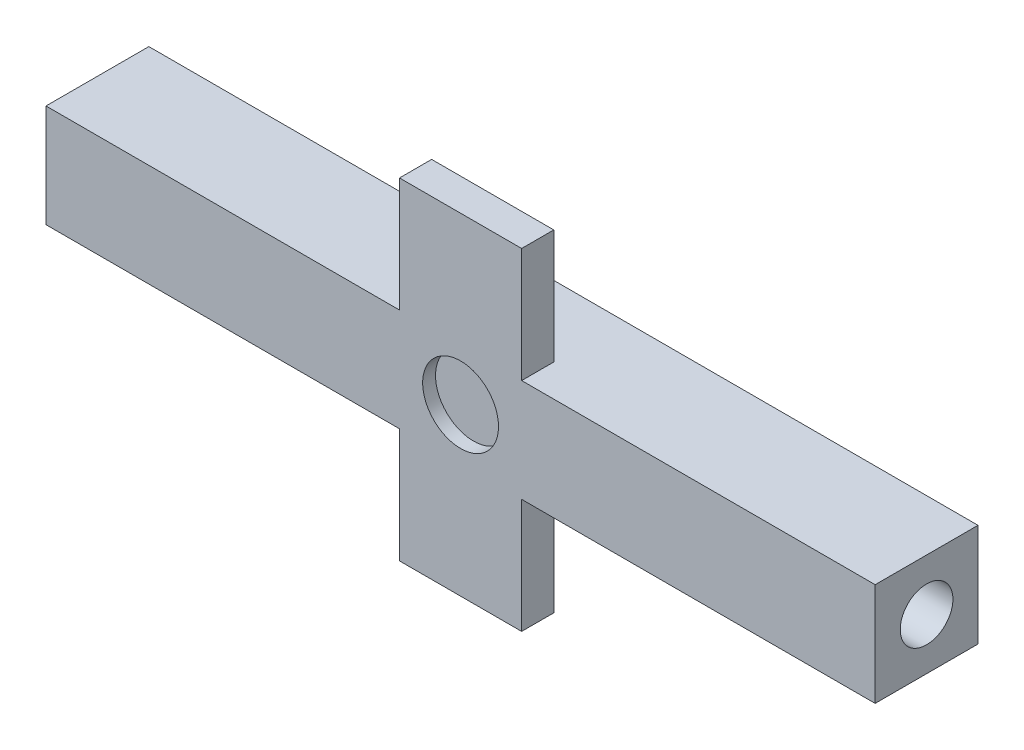
ISO-10303-21;
HEADER;
FILE_DESCRIPTION(('STEP AP214'),'2;1');
FILE_NAME('part.step','',(''),(''),'','','');
FILE_SCHEMA(('AUTOMOTIVE_DESIGN { 1 0 10303 214 1 1 1 1 }'));
ENDSEC;
DATA;
#1=APPLICATION_CONTEXT('core data for automotive mechanical design processes');
#2=APPLICATION_PROTOCOL_DEFINITION('international standard','automotive_design',2000,#1);
#3=PRODUCT_CONTEXT('',#1,'mechanical');
#4=PRODUCT('Part','Part','',(#3));
#5=PRODUCT_RELATED_PRODUCT_CATEGORY('part','',(#4));
#6=PRODUCT_DEFINITION_FORMATION('','',#4);
#7=PRODUCT_DEFINITION_CONTEXT('part definition',#1,'design');
#8=PRODUCT_DEFINITION('design','',#6,#7);
#9=PRODUCT_DEFINITION_SHAPE('','',#8);
#10=(LENGTH_UNIT() NAMED_UNIT(*) SI_UNIT(.MILLI.,.METRE.));
#11=(NAMED_UNIT(*) PLANE_ANGLE_UNIT() SI_UNIT($,.RADIAN.));
#12=(NAMED_UNIT(*) SI_UNIT($,.STERADIAN.) SOLID_ANGLE_UNIT());
#13=UNCERTAINTY_MEASURE_WITH_UNIT(LENGTH_MEASURE(1.E-05),#10,'distance_accuracy_value','');
#14=(GEOMETRIC_REPRESENTATION_CONTEXT(3) GLOBAL_UNCERTAINTY_ASSIGNED_CONTEXT((#13)) GLOBAL_UNIT_ASSIGNED_CONTEXT((#10,
#11,#12)) REPRESENTATION_CONTEXT('',''));
#15=CARTESIAN_POINT('',(0.,0.,0.));
#16=DIRECTION('',(0.,0.,1.));
#17=DIRECTION('',(1.,0.,0.));
#18=AXIS2_PLACEMENT_3D('',#15,#16,#17);
#19=CARTESIAN_POINT('',(81.915,10.16,0.));
#20=DIRECTION('',(0.,-1.,0.));
#21=DIRECTION('',(0.,0.,-1.));
#22=AXIS2_PLACEMENT_3D('',#19,#20,#21);
#23=PLANE('',#22);
#24=DIRECTION('',(0.,0.,-1.));
#25=VECTOR('',#24,1.);
#26=CARTESIAN_POINT('',(46.99,10.16,0.));
#27=LINE('',#26,#25);
#28=CARTESIAN_POINT('',(46.99,10.16,0.));
#29=VERTEX_POINT('',#28);
#30=CARTESIAN_POINT('',(46.99,10.16,-3.175));
#31=VERTEX_POINT('',#30);
#32=EDGE_CURVE('E151',#29,#31,#27,.T.);
#33=ORIENTED_EDGE('',*,*,#32,.F.);
#34=DIRECTION('',(-1.,0.,0.));
#35=VECTOR('',#34,1.);
#36=CARTESIAN_POINT('',(81.915,10.16,0.));
#37=LINE('',#36,#35);
#38=CARTESIAN_POINT('',(81.915,10.16,0.));
#39=VERTEX_POINT('',#38);
#40=EDGE_CURVE('E242',#39,#29,#37,.T.);
#41=ORIENTED_EDGE('',*,*,#40,.F.);
#42=DIRECTION('',(0.,0.,1.));
#43=VECTOR('',#42,1.);
#44=CARTESIAN_POINT('',(81.915,10.16,0.));
#45=LINE('',#44,#43);
#46=CARTESIAN_POINT('',(81.915,10.16,-10.16));
#47=VERTEX_POINT('',#46);
#48=EDGE_CURVE('E228',#47,#39,#45,.T.);
#49=ORIENTED_EDGE('',*,*,#48,.F.);
#50=DIRECTION('',(-1.,0.,0.));
#51=VECTOR('',#50,1.);
#52=CARTESIAN_POINT('',(81.915,10.16,-10.16));
#53=LINE('',#52,#51);
#54=CARTESIAN_POINT('',(0.,10.16,-10.16));
#55=VERTEX_POINT('',#54);
#56=EDGE_CURVE('E246',#47,#55,#53,.T.);
#57=ORIENTED_EDGE('',*,*,#56,.T.);
#58=DIRECTION('',(0.,0.,1.));
#59=VECTOR('',#58,1.);
#60=CARTESIAN_POINT('',(0.,10.16,0.));
#61=LINE('',#60,#59);
#62=CARTESIAN_POINT('',(0.,10.16,0.));
#63=VERTEX_POINT('',#62);
#64=EDGE_CURVE('E222',#55,#63,#61,.T.);
#65=ORIENTED_EDGE('',*,*,#64,.T.);
#66=CARTESIAN_POINT('',(34.925,10.16,0.));
#67=VERTEX_POINT('',#66);
#68=EDGE_CURVE('E61',#67,#63,#37,.T.);
#69=ORIENTED_EDGE('',*,*,#68,.F.);
#70=DIRECTION('',(0.,0.,1.));
#71=VECTOR('',#70,1.);
#72=CARTESIAN_POINT('',(34.925,10.16,0.));
#73=LINE('',#72,#71);
#74=CARTESIAN_POINT('',(34.925,10.16,-3.175));
#75=VERTEX_POINT('',#74);
#76=EDGE_CURVE('E148',#75,#67,#73,.T.);
#77=ORIENTED_EDGE('',*,*,#76,.F.);
#78=DIRECTION('',(-1.,0.,0.));
#79=VECTOR('',#78,1.);
#80=CARTESIAN_POINT('',(46.99,10.16,-3.175));
#81=LINE('',#80,#79);
#82=EDGE_CURVE('E55',#31,#75,#81,.T.);
#83=ORIENTED_EDGE('',*,*,#82,.F.);
#84=EDGE_LOOP('',(#33,#41,#49,#57,#65,#69,#77,#83));
#85=FACE_BOUND('',#84,.T.);
#86=ADVANCED_FACE('F39',(#85),#23,.F.);
#87=CARTESIAN_POINT('',(81.915,0.,0.));
#88=DIRECTION('',(0.,1.,0.));
#89=DIRECTION('',(0.,0.,1.));
#90=AXIS2_PLACEMENT_3D('',#87,#88,#89);
#91=PLANE('',#90);
#92=DIRECTION('',(0.,0.,1.));
#93=VECTOR('',#92,1.);
#94=CARTESIAN_POINT('',(46.99,0.,0.));
#95=LINE('',#94,#93);
#96=CARTESIAN_POINT('',(46.99,0.,-3.175));
#97=VERTEX_POINT('',#96);
#98=CARTESIAN_POINT('',(46.99,0.,0.));
#99=VERTEX_POINT('',#98);
#100=EDGE_CURVE('E153',#97,#99,#95,.T.);
#101=ORIENTED_EDGE('',*,*,#100,.F.);
#102=DIRECTION('',(1.,0.,0.));
#103=VECTOR('',#102,1.);
#104=CARTESIAN_POINT('',(46.99,0.,-3.175));
#105=LINE('',#104,#103);
#106=CARTESIAN_POINT('',(34.925,0.,-3.175));
#107=VERTEX_POINT('',#106);
#108=EDGE_CURVE('E169',#107,#97,#105,.T.);
#109=ORIENTED_EDGE('',*,*,#108,.F.);
#110=DIRECTION('',(0.,0.,-1.));
#111=VECTOR('',#110,1.);
#112=CARTESIAN_POINT('',(34.925,0.,0.));
#113=LINE('',#112,#111);
#114=CARTESIAN_POINT('',(34.925,0.,0.));
#115=VERTEX_POINT('',#114);
#116=EDGE_CURVE('E158',#115,#107,#113,.T.);
#117=ORIENTED_EDGE('',*,*,#116,.F.);
#118=DIRECTION('',(-1.,0.,0.));
#119=VECTOR('',#118,1.);
#120=CARTESIAN_POINT('',(81.915,0.,0.));
#121=LINE('',#120,#119);
#122=CARTESIAN_POINT('',(0.,0.,0.));
#123=VERTEX_POINT('',#122);
#124=EDGE_CURVE('E48',#115,#123,#121,.T.);
#125=ORIENTED_EDGE('',*,*,#124,.T.);
#126=DIRECTION('',(0.,0.,-1.));
#127=VECTOR('',#126,1.);
#128=CARTESIAN_POINT('',(0.,0.,0.));
#129=LINE('',#128,#127);
#130=CARTESIAN_POINT('',(0.,0.,-10.16));
#131=VERTEX_POINT('',#130);
#132=EDGE_CURVE('E234',#123,#131,#129,.T.);
#133=ORIENTED_EDGE('',*,*,#132,.T.);
#134=DIRECTION('',(-1.,0.,0.));
#135=VECTOR('',#134,1.);
#136=CARTESIAN_POINT('',(81.915,0.,-10.16));
#137=LINE('',#136,#135);
#138=CARTESIAN_POINT('',(81.915,0.,-10.16));
#139=VERTEX_POINT('',#138);
#140=EDGE_CURVE('E249',#139,#131,#137,.T.);
#141=ORIENTED_EDGE('',*,*,#140,.F.);
#142=DIRECTION('',(0.,0.,-1.));
#143=VECTOR('',#142,1.);
#144=CARTESIAN_POINT('',(81.915,0.,0.));
#145=LINE('',#144,#143);
#146=CARTESIAN_POINT('',(81.915,0.,0.));
#147=VERTEX_POINT('',#146);
#148=EDGE_CURVE('E221',#147,#139,#145,.T.);
#149=ORIENTED_EDGE('',*,*,#148,.F.);
#150=EDGE_CURVE('E11',#147,#99,#121,.T.);
#151=ORIENTED_EDGE('',*,*,#150,.T.);
#152=EDGE_LOOP('',(#101,#109,#117,#125,#133,#141,#149,#151));
#153=FACE_BOUND('',#152,.T.);
#154=ADVANCED_FACE('F260',(#153),#91,.F.);
#155=CARTESIAN_POINT('',(81.915,0.,0.));
#156=DIRECTION('',(0.,0.,-1.));
#157=DIRECTION('',(-1.,0.,0.));
#158=AXIS2_PLACEMENT_3D('',#155,#156,#157);
#159=PLANE('',#158);
#160=CARTESIAN_POINT('',(40.9575,5.08,0.));
#161=DIRECTION('',(0.,0.,1.));
#162=DIRECTION('',(1.,0.,0.));
#163=AXIS2_PLACEMENT_3D('',#160,#161,#162);
#164=CIRCLE('',#163,3.7465);
#165=CARTESIAN_POINT('',(44.704,5.08,0.));
#166=VERTEX_POINT('',#165);
#167=EDGE_CURVE('E200',#166,#166,#164,.T.);
#168=ORIENTED_EDGE('',*,*,#167,.F.);
#169=EDGE_LOOP('',(#168));
#170=FACE_BOUND('',#169,.T.);
#171=DIRECTION('',(0.,-1.,0.));
#172=VECTOR('',#171,1.);
#173=CARTESIAN_POINT('',(0.,0.,0.));
#174=LINE('',#173,#172);
#175=EDGE_CURVE('E213',#63,#123,#174,.T.);
#176=ORIENTED_EDGE('',*,*,#175,.T.);
#177=ORIENTED_EDGE('',*,*,#124,.F.);
#178=DIRECTION('',(0.,1.,0.));
#179=VECTOR('',#178,1.);
#180=CARTESIAN_POINT('',(34.925,-11.303,0.));
#181=LINE('',#180,#179);
#182=CARTESIAN_POINT('',(34.925,-11.303,0.));
#183=VERTEX_POINT('',#182);
#184=EDGE_CURVE('E192',#183,#115,#181,.T.);
#185=ORIENTED_EDGE('',*,*,#184,.F.);
#186=DIRECTION('',(-1.,0.,0.));
#187=VECTOR('',#186,1.);
#188=CARTESIAN_POINT('',(46.99,-11.303,0.));
#189=LINE('',#188,#187);
#190=CARTESIAN_POINT('',(46.99,-11.303,0.));
#191=VERTEX_POINT('',#190);
#192=EDGE_CURVE('E168',#191,#183,#189,.T.);
#193=ORIENTED_EDGE('',*,*,#192,.F.);
#194=DIRECTION('',(0.,1.,0.));
#195=VECTOR('',#194,1.);
#196=CARTESIAN_POINT('',(46.99,-11.303,0.));
#197=LINE('',#196,#195);
#198=EDGE_CURVE('E196',#191,#99,#197,.T.);
#199=ORIENTED_EDGE('',*,*,#198,.T.);
#200=ORIENTED_EDGE('',*,*,#150,.F.);
#201=DIRECTION('',(0.,-1.,0.));
#202=VECTOR('',#201,1.);
#203=CARTESIAN_POINT('',(81.915,0.,0.));
#204=LINE('',#203,#202);
#205=EDGE_CURVE('E217',#39,#147,#204,.T.);
#206=ORIENTED_EDGE('',*,*,#205,.F.);
#207=ORIENTED_EDGE('',*,*,#40,.T.);
#208=DIRECTION('',(0.,-1.,0.));
#209=VECTOR('',#208,1.);
#210=CARTESIAN_POINT('',(46.99,21.463,0.));
#211=LINE('',#210,#209);
#212=CARTESIAN_POINT('',(46.99,21.463,0.));
#213=VERTEX_POINT('',#212);
#214=EDGE_CURVE('E401',#213,#29,#211,.T.);
#215=ORIENTED_EDGE('',*,*,#214,.F.);
#216=DIRECTION('',(1.,0.,0.));
#217=VECTOR('',#216,1.);
#218=CARTESIAN_POINT('',(46.99,21.463,0.));
#219=LINE('',#218,#217);
#220=CARTESIAN_POINT('',(34.925,21.463,0.));
#221=VERTEX_POINT('',#220);
#222=EDGE_CURVE('E143',#221,#213,#219,.T.);
#223=ORIENTED_EDGE('',*,*,#222,.F.);
#224=DIRECTION('',(0.,-1.,0.));
#225=VECTOR('',#224,1.);
#226=CARTESIAN_POINT('',(34.925,21.463,0.));
#227=LINE('',#226,#225);
#228=EDGE_CURVE('E160',#221,#67,#227,.T.);
#229=ORIENTED_EDGE('',*,*,#228,.T.);
#230=ORIENTED_EDGE('',*,*,#68,.T.);
#231=EDGE_LOOP('',(#176,#177,#185,#193,#199,#200,#206,#207,#215,#223,#229,#230));
#232=FACE_BOUND('',#231,.T.);
#233=ADVANCED_FACE('F41',(#170,#232),#159,.F.);
#234=CARTESIAN_POINT('',(81.915,0.,-10.16));
#235=DIRECTION('',(0.,0.,1.));
#236=DIRECTION('',(1.,0.,0.));
#237=AXIS2_PLACEMENT_3D('',#234,#235,#236);
#238=PLANE('',#237);
#239=DIRECTION('',(0.,1.,0.));
#240=VECTOR('',#239,1.);
#241=CARTESIAN_POINT('',(0.,0.,-10.16));
#242=LINE('',#241,#240);
#243=EDGE_CURVE('E237',#131,#55,#242,.T.);
#244=ORIENTED_EDGE('',*,*,#243,.T.);
#245=ORIENTED_EDGE('',*,*,#56,.F.);
#246=DIRECTION('',(0.,1.,0.));
#247=VECTOR('',#246,1.);
#248=CARTESIAN_POINT('',(81.915,0.,-10.16));
#249=LINE('',#248,#247);
#250=EDGE_CURVE('E225',#139,#47,#249,.T.);
#251=ORIENTED_EDGE('',*,*,#250,.F.);
#252=ORIENTED_EDGE('',*,*,#140,.T.);
#253=EDGE_LOOP('',(#244,#245,#251,#252));
#254=FACE_BOUND('',#253,.T.);
#255=ADVANCED_FACE('F273',(#254),#238,.F.);
#256=CARTESIAN_POINT('',(81.915,0.,0.));
#257=DIRECTION('',(-1.,0.,0.));
#258=DIRECTION('',(0.,0.,1.));
#259=AXIS2_PLACEMENT_3D('',#256,#257,#258);
#260=PLANE('',#259);
#261=CARTESIAN_POINT('',(81.915,5.08,-5.08));
#262=DIRECTION('',(1.,0.,0.));
#263=DIRECTION('',(0.,0.,-1.));
#264=AXIS2_PLACEMENT_3D('',#261,#262,#263);
#265=CIRCLE('',#264,2.6035);
#266=CARTESIAN_POINT('',(81.915,5.08,-7.6835));
#267=VERTEX_POINT('',#266);
#268=EDGE_CURVE('E205',#267,#267,#265,.T.);
#269=ORIENTED_EDGE('',*,*,#268,.F.);
#270=EDGE_LOOP('',(#269));
#271=FACE_BOUND('',#270,.T.);
#272=ORIENTED_EDGE('',*,*,#205,.T.);
#273=ORIENTED_EDGE('',*,*,#148,.T.);
#274=ORIENTED_EDGE('',*,*,#250,.T.);
#275=ORIENTED_EDGE('',*,*,#48,.T.);
#276=EDGE_LOOP('',(#272,#273,#274,#275));
#277=FACE_BOUND('',#276,.T.);
#278=ADVANCED_FACE('F275',(#271,#277),#260,.F.);
#279=CARTESIAN_POINT('',(0.,0.,0.));
#280=DIRECTION('',(-1.,0.,0.));
#281=DIRECTION('',(0.,0.,1.));
#282=AXIS2_PLACEMENT_3D('',#279,#280,#281);
#283=PLANE('',#282);
#284=CARTESIAN_POINT('',(0.,5.08,-5.08));
#285=DIRECTION('',(1.,0.,0.));
#286=DIRECTION('',(0.,0.,-1.));
#287=AXIS2_PLACEMENT_3D('',#284,#285,#286);
#288=CIRCLE('',#287,2.6035);
#289=CARTESIAN_POINT('',(0.,5.08,-7.6835));
#290=VERTEX_POINT('',#289);
#291=EDGE_CURVE('E209',#290,#290,#288,.T.);
#292=ORIENTED_EDGE('',*,*,#291,.T.);
#293=EDGE_LOOP('',(#292));
#294=FACE_BOUND('',#293,.T.);
#295=ORIENTED_EDGE('',*,*,#175,.F.);
#296=ORIENTED_EDGE('',*,*,#64,.F.);
#297=ORIENTED_EDGE('',*,*,#243,.F.);
#298=ORIENTED_EDGE('',*,*,#132,.F.);
#299=EDGE_LOOP('',(#295,#296,#297,#298));
#300=FACE_BOUND('',#299,.T.);
#301=ADVANCED_FACE('F265',(#294,#300),#283,.T.);
#302=CARTESIAN_POINT('',(0.,5.08,-5.08));
#303=DIRECTION('',(1.,0.,0.));
#304=DIRECTION('',(0.,0.,-1.));
#305=AXIS2_PLACEMENT_3D('',#302,#303,#304);
#306=CYLINDRICAL_SURFACE('',#305,2.6035);
#307=ORIENTED_EDGE('',*,*,#291,.F.);
#308=EDGE_LOOP('',(#307));
#309=FACE_BOUND('',#308,.T.);
#310=ORIENTED_EDGE('',*,*,#268,.T.);
#311=EDGE_LOOP('',(#310));
#312=FACE_BOUND('',#311,.T.);
#313=ADVANCED_FACE('F322',(#309,#312),#306,.F.);
#314=CARTESIAN_POINT('',(40.9575,5.08,-1.27));
#315=DIRECTION('',(0.,0.,1.));
#316=DIRECTION('',(1.,0.,0.));
#317=AXIS2_PLACEMENT_3D('',#314,#315,#316);
#318=CYLINDRICAL_SURFACE('',#317,3.7465);
#319=CARTESIAN_POINT('',(40.9575,5.08,-1.27));
#320=DIRECTION('',(0.,0.,1.));
#321=DIRECTION('',(1.,0.,0.));
#322=AXIS2_PLACEMENT_3D('',#319,#320,#321);
#323=CIRCLE('',#322,3.7465);
#324=CARTESIAN_POINT('',(44.704,5.08,-1.27));
#325=VERTEX_POINT('',#324);
#326=EDGE_CURVE('E201',#325,#325,#323,.T.);
#327=ORIENTED_EDGE('',*,*,#326,.F.);
#328=EDGE_LOOP('',(#327));
#329=FACE_BOUND('',#328,.T.);
#330=ORIENTED_EDGE('',*,*,#167,.T.);
#331=EDGE_LOOP('',(#330));
#332=FACE_BOUND('',#331,.T.);
#333=ADVANCED_FACE('F319',(#329,#332),#318,.F.);
#334=CARTESIAN_POINT('',(40.9575,5.08,-1.27));
#335=DIRECTION('',(0.,0.,1.));
#336=DIRECTION('',(1.,0.,0.));
#337=AXIS2_PLACEMENT_3D('',#334,#335,#336);
#338=PLANE('',#337);
#339=ORIENTED_EDGE('',*,*,#326,.T.);
#340=EDGE_LOOP('',(#339));
#341=FACE_BOUND('',#340,.T.);
#342=ADVANCED_FACE('F321',(#341),#338,.T.);
#343=CARTESIAN_POINT('',(46.99,-11.303,0.));
#344=DIRECTION('',(-1.,0.,0.));
#345=DIRECTION('',(0.,0.,1.));
#346=AXIS2_PLACEMENT_3D('',#343,#344,#345);
#347=PLANE('',#346);
#348=ORIENTED_EDGE('',*,*,#100,.T.);
#349=ORIENTED_EDGE('',*,*,#198,.F.);
#350=DIRECTION('',(0.,0.,1.));
#351=VECTOR('',#350,1.);
#352=CARTESIAN_POINT('',(46.99,-11.303,0.));
#353=LINE('',#352,#351);
#354=CARTESIAN_POINT('',(46.99,-11.303,-3.175));
#355=VERTEX_POINT('',#354);
#356=EDGE_CURVE('E164',#355,#191,#353,.T.);
#357=ORIENTED_EDGE('',*,*,#356,.F.);
#358=DIRECTION('',(0.,1.,0.));
#359=VECTOR('',#358,1.);
#360=CARTESIAN_POINT('',(46.99,-11.303,-3.175));
#361=LINE('',#360,#359);
#362=EDGE_CURVE('E177',#355,#97,#361,.T.);
#363=ORIENTED_EDGE('',*,*,#362,.T.);
#364=EDGE_LOOP('',(#348,#349,#357,#363));
#365=FACE_BOUND('',#364,.T.);
#366=ADVANCED_FACE('F281',(#365),#347,.F.);
#367=CARTESIAN_POINT('',(34.925,-11.303,0.));
#368=DIRECTION('',(1.,0.,0.));
#369=DIRECTION('',(0.,0.,-1.));
#370=AXIS2_PLACEMENT_3D('',#367,#368,#369);
#371=PLANE('',#370);
#372=ORIENTED_EDGE('',*,*,#116,.T.);
#373=DIRECTION('',(0.,1.,0.));
#374=VECTOR('',#373,1.);
#375=CARTESIAN_POINT('',(34.925,-11.303,-3.175));
#376=LINE('',#375,#374);
#377=CARTESIAN_POINT('',(34.925,-11.303,-3.175));
#378=VERTEX_POINT('',#377);
#379=EDGE_CURVE('E188',#378,#107,#376,.T.);
#380=ORIENTED_EDGE('',*,*,#379,.F.);
#381=DIRECTION('',(0.,0.,-1.));
#382=VECTOR('',#381,1.);
#383=CARTESIAN_POINT('',(34.925,-11.303,0.));
#384=LINE('',#383,#382);
#385=EDGE_CURVE('E172',#183,#378,#384,.T.);
#386=ORIENTED_EDGE('',*,*,#385,.F.);
#387=ORIENTED_EDGE('',*,*,#184,.T.);
#388=EDGE_LOOP('',(#372,#380,#386,#387));
#389=FACE_BOUND('',#388,.T.);
#390=ADVANCED_FACE('F288',(#389),#371,.F.);
#391=CARTESIAN_POINT('',(46.99,-11.303,-3.175));
#392=DIRECTION('',(0.,0.,1.));
#393=DIRECTION('',(1.,0.,0.));
#394=AXIS2_PLACEMENT_3D('',#391,#392,#393);
#395=PLANE('',#394);
#396=ORIENTED_EDGE('',*,*,#108,.T.);
#397=ORIENTED_EDGE('',*,*,#362,.F.);
#398=DIRECTION('',(1.,0.,0.));
#399=VECTOR('',#398,1.);
#400=CARTESIAN_POINT('',(46.99,-11.303,-3.175));
#401=LINE('',#400,#399);
#402=EDGE_CURVE('E175',#378,#355,#401,.T.);
#403=ORIENTED_EDGE('',*,*,#402,.F.);
#404=ORIENTED_EDGE('',*,*,#379,.T.);
#405=EDGE_LOOP('',(#396,#397,#403,#404));
#406=FACE_BOUND('',#405,.T.);
#407=ADVANCED_FACE('F285',(#406),#395,.F.);
#408=CARTESIAN_POINT('',(0.,-11.303,0.));
#409=DIRECTION('',(0.,1.,0.));
#410=DIRECTION('',(0.,0.,1.));
#411=AXIS2_PLACEMENT_3D('',#408,#409,#410);
#412=PLANE('',#411);
#413=ORIENTED_EDGE('',*,*,#356,.T.);
#414=ORIENTED_EDGE('',*,*,#192,.T.);
#415=ORIENTED_EDGE('',*,*,#385,.T.);
#416=ORIENTED_EDGE('',*,*,#402,.T.);
#417=EDGE_LOOP('',(#413,#414,#415,#416));
#418=FACE_BOUND('',#417,.T.);
#419=ADVANCED_FACE('F291',(#418),#412,.F.);
#420=CARTESIAN_POINT('',(46.99,21.463,0.));
#421=DIRECTION('',(-1.,0.,0.));
#422=DIRECTION('',(0.,0.,1.));
#423=AXIS2_PLACEMENT_3D('',#420,#421,#422);
#424=PLANE('',#423);
#425=ORIENTED_EDGE('',*,*,#32,.T.);
#426=DIRECTION('',(0.,-1.,0.));
#427=VECTOR('',#426,1.);
#428=CARTESIAN_POINT('',(46.99,21.463,-3.175));
#429=LINE('',#428,#427);
#430=CARTESIAN_POINT('',(46.99,21.463,-3.175));
#431=VERTEX_POINT('',#430);
#432=EDGE_CURVE('E130',#431,#31,#429,.T.);
#433=ORIENTED_EDGE('',*,*,#432,.F.);
#434=DIRECTION('',(0.,0.,-1.));
#435=VECTOR('',#434,1.);
#436=CARTESIAN_POINT('',(46.99,21.463,0.));
#437=LINE('',#436,#435);
#438=EDGE_CURVE('E138',#213,#431,#437,.T.);
#439=ORIENTED_EDGE('',*,*,#438,.F.);
#440=ORIENTED_EDGE('',*,*,#214,.T.);
#441=EDGE_LOOP('',(#425,#433,#439,#440));
#442=FACE_BOUND('',#441,.T.);
#443=ADVANCED_FACE('F150',(#442),#424,.F.);
#444=CARTESIAN_POINT('',(46.99,21.463,-3.175));
#445=DIRECTION('',(0.,0.,1.));
#446=DIRECTION('',(1.,0.,0.));
#447=AXIS2_PLACEMENT_3D('',#444,#445,#446);
#448=PLANE('',#447);
#449=ORIENTED_EDGE('',*,*,#82,.T.);
#450=DIRECTION('',(0.,-1.,0.));
#451=VECTOR('',#450,1.);
#452=CARTESIAN_POINT('',(34.925,21.463,-3.175));
#453=LINE('',#452,#451);
#454=CARTESIAN_POINT('',(34.925,21.463,-3.175));
#455=VERTEX_POINT('',#454);
#456=EDGE_CURVE('E133',#455,#75,#453,.T.);
#457=ORIENTED_EDGE('',*,*,#456,.F.);
#458=DIRECTION('',(-1.,0.,0.));
#459=VECTOR('',#458,1.);
#460=CARTESIAN_POINT('',(46.99,21.463,-3.175));
#461=LINE('',#460,#459);
#462=EDGE_CURVE('E126',#431,#455,#461,.T.);
#463=ORIENTED_EDGE('',*,*,#462,.F.);
#464=ORIENTED_EDGE('',*,*,#432,.T.);
#465=EDGE_LOOP('',(#449,#457,#463,#464));
#466=FACE_BOUND('',#465,.T.);
#467=ADVANCED_FACE('F128',(#466),#448,.F.);
#468=CARTESIAN_POINT('',(34.925,21.463,0.));
#469=DIRECTION('',(1.,0.,0.));
#470=DIRECTION('',(0.,0.,-1.));
#471=AXIS2_PLACEMENT_3D('',#468,#469,#470);
#472=PLANE('',#471);
#473=ORIENTED_EDGE('',*,*,#76,.T.);
#474=ORIENTED_EDGE('',*,*,#228,.F.);
#475=DIRECTION('',(0.,0.,1.));
#476=VECTOR('',#475,1.);
#477=CARTESIAN_POINT('',(34.925,21.463,0.));
#478=LINE('',#477,#476);
#479=EDGE_CURVE('E137',#455,#221,#478,.T.);
#480=ORIENTED_EDGE('',*,*,#479,.F.);
#481=ORIENTED_EDGE('',*,*,#456,.T.);
#482=EDGE_LOOP('',(#473,#474,#480,#481));
#483=FACE_BOUND('',#482,.T.);
#484=ADVANCED_FACE('F374',(#483),#472,.F.);
#485=CARTESIAN_POINT('',(0.,21.463,0.));
#486=DIRECTION('',(0.,1.,0.));
#487=DIRECTION('',(0.,0.,1.));
#488=AXIS2_PLACEMENT_3D('',#485,#486,#487);
#489=PLANE('',#488);
#490=ORIENTED_EDGE('',*,*,#438,.T.);
#491=ORIENTED_EDGE('',*,*,#462,.T.);
#492=ORIENTED_EDGE('',*,*,#479,.T.);
#493=ORIENTED_EDGE('',*,*,#222,.T.);
#494=EDGE_LOOP('',(#490,#491,#492,#493));
#495=FACE_BOUND('',#494,.T.);
#496=ADVANCED_FACE('F141',(#495),#489,.T.);
#497=CLOSED_SHELL('',(#86,#154,#233,#255,#278,#301,#313,#333,#342,#366,#390,#407,#419,#443,#467,
#484,#496));
#498=MANIFOLD_SOLID_BREP('B2',#497);
#499=ADVANCED_BREP_SHAPE_REPRESENTATION('',(#18,#498),#14);
#500=SHAPE_DEFINITION_REPRESENTATION(#9,#499);
ENDSEC;
END-ISO-10303-21;
